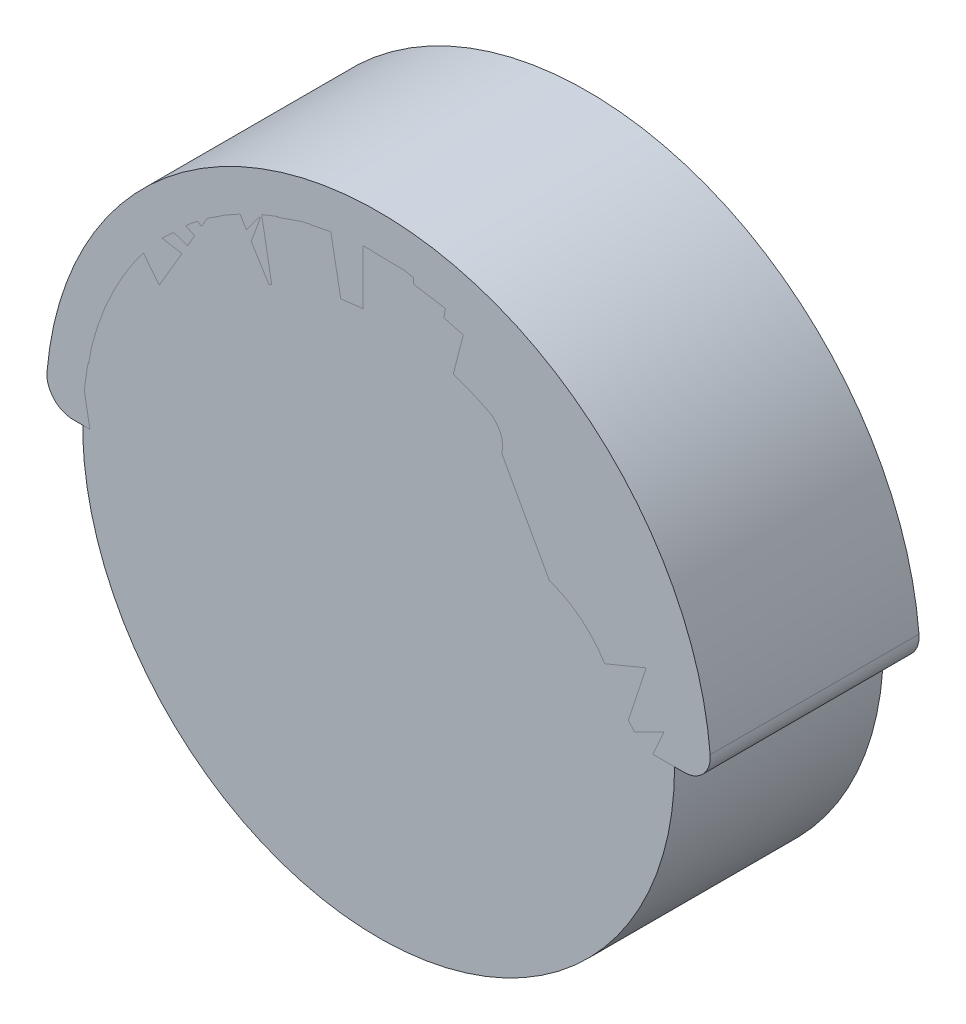
ISO-10303-21;
HEADER;
FILE_DESCRIPTION(('STEP AP214'),'2;1');
FILE_NAME('part.step','',(''),(''),'','','');
FILE_SCHEMA(('AUTOMOTIVE_DESIGN { 1 0 10303 214 1 1 1 1 }'));
ENDSEC;
DATA;
#1=APPLICATION_CONTEXT('core data for automotive mechanical design processes');
#2=APPLICATION_PROTOCOL_DEFINITION('international standard','automotive_design',2000,#1);
#3=PRODUCT_CONTEXT('',#1,'mechanical');
#4=PRODUCT('Part','Part','',(#3));
#5=PRODUCT_RELATED_PRODUCT_CATEGORY('part','',(#4));
#6=PRODUCT_DEFINITION_FORMATION('','',#4);
#7=PRODUCT_DEFINITION_CONTEXT('part definition',#1,'design');
#8=PRODUCT_DEFINITION('design','',#6,#7);
#9=PRODUCT_DEFINITION_SHAPE('','',#8);
#10=(LENGTH_UNIT() NAMED_UNIT(*) SI_UNIT(.MILLI.,.METRE.));
#11=(NAMED_UNIT(*) PLANE_ANGLE_UNIT() SI_UNIT($,.RADIAN.));
#12=(NAMED_UNIT(*) SI_UNIT($,.STERADIAN.) SOLID_ANGLE_UNIT());
#13=UNCERTAINTY_MEASURE_WITH_UNIT(LENGTH_MEASURE(1.E-05),#10,'distance_accuracy_value','');
#14=(GEOMETRIC_REPRESENTATION_CONTEXT(3) GLOBAL_UNCERTAINTY_ASSIGNED_CONTEXT((#13)) GLOBAL_UNIT_ASSIGNED_CONTEXT((#10,
#11,#12)) REPRESENTATION_CONTEXT('',''));
#15=CARTESIAN_POINT('',(0.,0.,0.));
#16=DIRECTION('',(0.,0.,1.));
#17=DIRECTION('',(1.,0.,0.));
#18=AXIS2_PLACEMENT_3D('',#15,#16,#17);
#19=CARTESIAN_POINT('',(0.,0.,-32.0745975710979));
#20=DIRECTION('',(0.,0.,1.));
#21=DIRECTION('',(1.,0.,0.));
#22=AXIS2_PLACEMENT_3D('',#19,#20,#21);
#23=CYLINDRICAL_SURFACE('',#22,11.3400827231764);
#24=CARTESIAN_POINT('',(0.,0.,0.));
#25=DIRECTION('',(0.,0.,1.));
#26=DIRECTION('',(1.,0.,0.));
#27=AXIS2_PLACEMENT_3D('',#24,#25,#26);
#28=CIRCLE('',#27,11.3400827231764);
#29=CARTESIAN_POINT('',(11.3400827231764,0.,0.));
#30=VERTEX_POINT('',#29);
#31=EDGE_CURVE('P0_E10',#30,#30,#28,.F.);
#32=ORIENTED_EDGE('',*,*,#31,.F.);
#33=EDGE_LOOP('',(#32));
#34=FACE_BOUND('',#33,.T.);
#35=CARTESIAN_POINT('',(0.,0.,8.));
#36=DIRECTION('',(0.,0.,1.));
#37=DIRECTION('',(1.,0.,0.));
#38=AXIS2_PLACEMENT_3D('',#35,#36,#37);
#39=CIRCLE('',#38,11.3400827231764);
#40=CARTESIAN_POINT('',(11.3400827231764,0.,8.));
#41=VERTEX_POINT('',#40);
#42=EDGE_CURVE('P0_E45',#41,#41,#39,.T.);
#43=ORIENTED_EDGE('',*,*,#42,.F.);
#44=EDGE_LOOP('',(#43));
#45=FACE_BOUND('',#44,.T.);
#46=ADVANCED_FACE('P0_F39',(#34,#45),#23,.T.);
#47=CARTESIAN_POINT('',(0.,0.,8.));
#48=DIRECTION('',(0.,0.,1.));
#49=DIRECTION('',(1.,0.,0.));
#50=AXIS2_PLACEMENT_3D('',#47,#48,#49);
#51=PLANE('',#50);
#52=ORIENTED_EDGE('',*,*,#42,.T.);
#53=EDGE_LOOP('',(#52));
#54=FACE_BOUND('',#53,.T.);
#55=ADVANCED_FACE('P0_F51',(#54),#51,.T.);
#56=CARTESIAN_POINT('',(0.,0.,0.));
#57=DIRECTION('',(0.,0.,1.));
#58=DIRECTION('',(1.,0.,0.));
#59=AXIS2_PLACEMENT_3D('',#56,#57,#58);
#60=PLANE('',#59);
#61=ORIENTED_EDGE('',*,*,#31,.T.);
#62=EDGE_LOOP('',(#61));
#63=FACE_BOUND('',#62,.T.);
#64=ADVANCED_FACE('P0_F58',(#63),#60,.F.);
#65=CLOSED_SHELL('',(#46,#55,#64));
#66=MANIFOLD_SOLID_BREP('P0_B2',#65);
#67=CARTESIAN_POINT('',(11.7073694739681,1.,8.));
#68=DIRECTION('',(0.,0.,1.));
#69=DIRECTION('',(1.,0.,0.));
#70=AXIS2_PLACEMENT_3D('',#67,#68,#69);
#71=CYLINDRICAL_SURFACE('',#70,1.);
#72=CARTESIAN_POINT('',(11.7073694739681,1.,8.));
#73=DIRECTION('',(0.,0.,-1.));
#74=DIRECTION('',(0.,-1.,0.));
#75=AXIS2_PLACEMENT_3D('',#72,#73,#74);
#76=CIRCLE('',#75,1.);
#77=CARTESIAN_POINT('',(12.703741344093,1.08510638297872,8.));
#78=VERTEX_POINT('',#77);
#79=CARTESIAN_POINT('',(11.7073694739681,0.,8.));
#80=VERTEX_POINT('',#79);
#81=EDGE_CURVE('P1_E11',#78,#80,#76,.T.);
#82=ORIENTED_EDGE('',*,*,#81,.T.);
#83=DIRECTION('',(0.,0.,-1.));
#84=VECTOR('',#83,1.);
#85=CARTESIAN_POINT('',(11.7073694739681,0.,8.));
#86=LINE('',#85,#84);
#87=CARTESIAN_POINT('',(11.7073694739681,0.,0.));
#88=VERTEX_POINT('',#87);
#89=EDGE_CURVE('P1_E27',#80,#88,#86,.T.);
#90=ORIENTED_EDGE('',*,*,#89,.T.);
#91=CARTESIAN_POINT('',(11.7073694739681,1.,0.));
#92=DIRECTION('',(0.,0.,1.));
#93=DIRECTION('',(1.,0.,0.));
#94=AXIS2_PLACEMENT_3D('',#91,#92,#93);
#95=CIRCLE('',#94,1.);
#96=CARTESIAN_POINT('',(12.703741344093,1.08510638297872,0.));
#97=VERTEX_POINT('',#96);
#98=EDGE_CURVE('P1_E325',#88,#97,#95,.T.);
#99=ORIENTED_EDGE('',*,*,#98,.T.);
#100=DIRECTION('',(0.,0.,1.));
#101=VECTOR('',#100,1.);
#102=CARTESIAN_POINT('',(12.703741344093,1.08510638297872,8.));
#103=LINE('',#102,#101);
#104=EDGE_CURVE('P1_E326',#97,#78,#103,.T.);
#105=ORIENTED_EDGE('',*,*,#104,.T.);
#106=EDGE_LOOP('',(#82,#90,#99,#105));
#107=FACE_BOUND('',#106,.T.);
#108=ADVANCED_FACE('P1_F17',(#107),#71,.T.);
#109=CARTESIAN_POINT('',(0.,0.,8.));
#110=DIRECTION('',(0.,0.,-1.));
#111=DIRECTION('',(0.,-1.,0.));
#112=AXIS2_PLACEMENT_3D('',#109,#110,#111);
#113=CYLINDRICAL_SURFACE('',#112,12.75);
#114=ORIENTED_EDGE('',*,*,#104,.F.);
#115=CARTESIAN_POINT('',(0.,0.,0.));
#116=DIRECTION('',(0.,0.,-1.));
#117=DIRECTION('',(0.,-1.,0.));
#118=AXIS2_PLACEMENT_3D('',#115,#116,#117);
#119=CIRCLE('',#118,12.75);
#120=CARTESIAN_POINT('',(-12.703741344093,1.08510638297872,0.));
#121=VERTEX_POINT('',#120);
#122=EDGE_CURVE('P1_E208',#121,#97,#119,.T.);
#123=ORIENTED_EDGE('',*,*,#122,.F.);
#124=DIRECTION('',(0.,0.,-1.));
#125=VECTOR('',#124,1.);
#126=CARTESIAN_POINT('',(-12.703741344093,1.08510638297872,8.));
#127=LINE('',#126,#125);
#128=CARTESIAN_POINT('',(-12.703741344093,1.08510638297872,8.));
#129=VERTEX_POINT('',#128);
#130=EDGE_CURVE('P1_E243',#129,#121,#127,.T.);
#131=ORIENTED_EDGE('',*,*,#130,.F.);
#132=CARTESIAN_POINT('',(0.,0.,8.));
#133=DIRECTION('',(0.,0.,1.));
#134=DIRECTION('',(0.,-1.,0.));
#135=AXIS2_PLACEMENT_3D('',#132,#133,#134);
#136=CIRCLE('',#135,12.75);
#137=EDGE_CURVE('P1_E304',#78,#129,#136,.T.);
#138=ORIENTED_EDGE('',*,*,#137,.F.);
#139=EDGE_LOOP('',(#114,#123,#131,#138));
#140=FACE_BOUND('',#139,.T.);
#141=ADVANCED_FACE('P1_F338',(#140),#113,.T.);
#142=CARTESIAN_POINT('',(0.,0.,0.));
#143=DIRECTION('',(0.,0.,1.));
#144=DIRECTION('',(1.,0.,0.));
#145=AXIS2_PLACEMENT_3D('',#142,#143,#144);
#146=PLANE('',#145);
#147=ORIENTED_EDGE('',*,*,#98,.F.);
#148=DIRECTION('',(-1.,0.,0.));
#149=VECTOR('',#148,1.);
#150=CARTESIAN_POINT('',(9.25,0.,0.));
#151=LINE('',#150,#149);
#152=CARTESIAN_POINT('',(10.1489794855664,0.,0.));
#153=VERTEX_POINT('',#152);
#154=EDGE_CURVE('P1_E183',#88,#153,#151,.T.);
#155=ORIENTED_EDGE('',*,*,#154,.T.);
#156=CARTESIAN_POINT('',(10.1489794855664,1.,0.));
#157=DIRECTION('',(0.,0.,1.));
#158=DIRECTION('',(1.,0.,0.));
#159=AXIS2_PLACEMENT_3D('',#156,#157,#158);
#160=CIRCLE('',#159,1.);
#161=CARTESIAN_POINT('',(9.16918358845309,0.800000000000001,0.));
#162=VERTEX_POINT('',#161);
#163=EDGE_CURVE('P1_E174',#162,#153,#160,.T.);
#164=ORIENTED_EDGE('',*,*,#163,.F.);
#165=CARTESIAN_POINT('',(5.25,0.,0.));
#166=DIRECTION('',(0.,0.,1.));
#167=DIRECTION('',(1.,0.,0.));
#168=AXIS2_PLACEMENT_3D('',#165,#166,#167);
#169=CIRCLE('',#168,4.);
#170=CARTESIAN_POINT('',(2.63888888888889,3.03019780962103,0.));
#171=VERTEX_POINT('',#170);
#172=EDGE_CURVE('P1_E185',#162,#171,#169,.T.);
#173=ORIENTED_EDGE('',*,*,#172,.T.);
#174=CARTESIAN_POINT('',(3.29166666666667,2.27264835721577,0.));
#175=DIRECTION('',(0.,0.,-1.));
#176=DIRECTION('',(0.,-1.,0.));
#177=AXIS2_PLACEMENT_3D('',#174,#175,#176);
#178=CIRCLE('',#177,1.);
#179=CARTESIAN_POINT('',(2.46875,1.70448626791183,0.));
#180=VERTEX_POINT('',#179);
#181=EDGE_CURVE('P1_E189',#180,#171,#178,.T.);
#182=ORIENTED_EDGE('',*,*,#181,.F.);
#183=CARTESIAN_POINT('',(0.,0.,0.));
#184=DIRECTION('',(0.,0.,-1.));
#185=DIRECTION('',(0.,-1.,0.));
#186=AXIS2_PLACEMENT_3D('',#183,#184,#185);
#187=CIRCLE('',#186,3.);
#188=CARTESIAN_POINT('',(-2.46875,1.70448626791183,0.));
#189=VERTEX_POINT('',#188);
#190=EDGE_CURVE('P1_E188',#180,#189,#187,.T.);
#191=ORIENTED_EDGE('',*,*,#190,.T.);
#192=CARTESIAN_POINT('',(-3.29166666666667,2.27264835721577,0.));
#193=DIRECTION('',(0.,0.,-1.));
#194=DIRECTION('',(0.,-1.,0.));
#195=AXIS2_PLACEMENT_3D('',#192,#193,#194);
#196=CIRCLE('',#195,1.);
#197=CARTESIAN_POINT('',(-2.63888888888889,3.03019780962103,0.));
#198=VERTEX_POINT('',#197);
#199=EDGE_CURVE('P1_E196',#198,#189,#196,.T.);
#200=ORIENTED_EDGE('',*,*,#199,.F.);
#201=CARTESIAN_POINT('',(-5.25,0.,0.));
#202=DIRECTION('',(0.,0.,1.));
#203=DIRECTION('',(1.,0.,0.));
#204=AXIS2_PLACEMENT_3D('',#201,#202,#203);
#205=CIRCLE('',#204,4.);
#206=CARTESIAN_POINT('',(-9.16918358845309,0.8,0.));
#207=VERTEX_POINT('',#206);
#208=EDGE_CURVE('P1_E195',#198,#207,#205,.T.);
#209=ORIENTED_EDGE('',*,*,#208,.T.);
#210=CARTESIAN_POINT('',(-10.1489794855664,1.,0.));
#211=DIRECTION('',(0.,0.,1.));
#212=DIRECTION('',(1.,0.,0.));
#213=AXIS2_PLACEMENT_3D('',#210,#211,#212);
#214=CIRCLE('',#213,1.);
#215=CARTESIAN_POINT('',(-10.1489794855664,0.,0.));
#216=VERTEX_POINT('',#215);
#217=EDGE_CURVE('P1_E202',#216,#207,#214,.T.);
#218=ORIENTED_EDGE('',*,*,#217,.F.);
#219=DIRECTION('',(-1.,0.,0.));
#220=VECTOR('',#219,1.);
#221=CARTESIAN_POINT('',(-11.75,0.,0.));
#222=LINE('',#221,#220);
#223=CARTESIAN_POINT('',(-11.7073694739681,0.,0.));
#224=VERTEX_POINT('',#223);
#225=EDGE_CURVE('P1_E201',#216,#224,#222,.T.);
#226=ORIENTED_EDGE('',*,*,#225,.T.);
#227=CARTESIAN_POINT('',(-11.7073694739681,0.999999999999999,0.));
#228=DIRECTION('',(0.,0.,1.));
#229=DIRECTION('',(1.,0.,0.));
#230=AXIS2_PLACEMENT_3D('',#227,#228,#229);
#231=CIRCLE('',#230,1.);
#232=EDGE_CURVE('P1_E209',#121,#224,#231,.T.);
#233=ORIENTED_EDGE('',*,*,#232,.F.);
#234=ORIENTED_EDGE('',*,*,#122,.T.);
#235=EDGE_LOOP('',(#147,#155,#164,#173,#182,#191,#200,#209,#218,#226,#233,#234));
#236=FACE_BOUND('',#235,.T.);
#237=CARTESIAN_POINT('',(5.25,0.,0.));
#238=DIRECTION('',(0.,0.,-1.));
#239=DIRECTION('',(0.,-1.,0.));
#240=AXIS2_PLACEMENT_3D('',#237,#238,#239);
#241=CIRCLE('',#240,6.5);
#242=CARTESIAN_POINT('',(0.700000000000001,4.64192847855285,0.));
#243=VERTEX_POINT('',#242);
#244=CARTESIAN_POINT('',(3.95,6.36867333123626,0.));
#245=VERTEX_POINT('',#244);
#246=EDGE_CURVE('P1_E213',#243,#245,#241,.T.);
#247=ORIENTED_EDGE('',*,*,#246,.T.);
#248=CARTESIAN_POINT('',(3.75,7.34846922834953,0.));
#249=DIRECTION('',(0.,0.,-1.));
#250=DIRECTION('',(0.,-1.,0.));
#251=AXIS2_PLACEMENT_3D('',#248,#249,#250);
#252=CIRCLE('',#251,1.);
#253=CARTESIAN_POINT('',(4.20454545454546,8.23919277117978,0.));
#254=VERTEX_POINT('',#253);
#255=EDGE_CURVE('P1_E217',#254,#245,#252,.T.);
#256=ORIENTED_EDGE('',*,*,#255,.F.);
#257=CARTESIAN_POINT('',(0.,0.,0.));
#258=DIRECTION('',(0.,0.,1.));
#259=DIRECTION('',(1.,0.,0.));
#260=AXIS2_PLACEMENT_3D('',#257,#258,#259);
#261=CIRCLE('',#260,9.25);
#262=CARTESIAN_POINT('',(-4.20454545454546,8.23919277117978,0.));
#263=VERTEX_POINT('',#262);
#264=EDGE_CURVE('P1_E216',#254,#263,#261,.T.);
#265=ORIENTED_EDGE('',*,*,#264,.T.);
#266=CARTESIAN_POINT('',(-3.75,7.34846922834953,0.));
#267=DIRECTION('',(0.,0.,-1.));
#268=DIRECTION('',(0.,-1.,0.));
#269=AXIS2_PLACEMENT_3D('',#266,#267,#268);
#270=CIRCLE('',#269,1.);
#271=CARTESIAN_POINT('',(-3.95,6.36867333123626,0.));
#272=VERTEX_POINT('',#271);
#273=EDGE_CURVE('P1_E224',#272,#263,#270,.T.);
#274=ORIENTED_EDGE('',*,*,#273,.F.);
#275=CARTESIAN_POINT('',(-5.25,0.,0.));
#276=DIRECTION('',(0.,0.,-1.));
#277=DIRECTION('',(0.,-1.,0.));
#278=AXIS2_PLACEMENT_3D('',#275,#276,#277);
#279=CIRCLE('',#278,6.5);
#280=CARTESIAN_POINT('',(-0.7,4.64192847855285,0.));
#281=VERTEX_POINT('',#280);
#282=EDGE_CURVE('P1_E223',#272,#281,#279,.T.);
#283=ORIENTED_EDGE('',*,*,#282,.T.);
#284=CARTESIAN_POINT('',(0.,5.35607132140714,0.));
#285=DIRECTION('',(0.,0.,-1.));
#286=DIRECTION('',(0.,-1.,0.));
#287=AXIS2_PLACEMENT_3D('',#284,#285,#286);
#288=CIRCLE('',#287,1.);
#289=EDGE_CURVE('P1_E231',#243,#281,#288,.T.);
#290=ORIENTED_EDGE('',*,*,#289,.F.);
#291=EDGE_LOOP('',(#247,#256,#265,#274,#283,#290));
#292=FACE_BOUND('',#291,.T.);
#293=CARTESIAN_POINT('',(0.,0.,0.));
#294=DIRECTION('',(0.,0.,1.));
#295=DIRECTION('',(1.,0.,0.));
#296=AXIS2_PLACEMENT_3D('',#293,#294,#295);
#297=CIRCLE('',#296,1.575);
#298=CARTESIAN_POINT('',(1.12722003175955,-1.1,0.));
#299=VERTEX_POINT('',#298);
#300=CARTESIAN_POINT('',(-1.12722003175955,-1.1,0.));
#301=VERTEX_POINT('',#300);
#302=EDGE_CURVE('P1_E230',#299,#301,#297,.T.);
#303=ORIENTED_EDGE('',*,*,#302,.T.);
#304=DIRECTION('',(1.,0.,0.));
#305=VECTOR('',#304,1.);
#306=CARTESIAN_POINT('',(1.12722003175955,-1.1,0.));
#307=LINE('',#306,#305);
#308=EDGE_CURVE('P1_E211',#301,#299,#307,.T.);
#309=ORIENTED_EDGE('',*,*,#308,.T.);
#310=EDGE_LOOP('',(#303,#309));
#311=FACE_BOUND('',#310,.T.);
#312=ADVANCED_FACE('P1_F321',(#236,#292,#311),#146,.F.);
#313=CARTESIAN_POINT('',(-11.7073694739681,0.999999999999999,8.));
#314=DIRECTION('',(0.,0.,-1.));
#315=DIRECTION('',(0.,-1.,0.));
#316=AXIS2_PLACEMENT_3D('',#313,#314,#315);
#317=CYLINDRICAL_SURFACE('',#316,1.);
#318=ORIENTED_EDGE('',*,*,#232,.T.);
#319=DIRECTION('',(0.,0.,1.));
#320=VECTOR('',#319,1.);
#321=CARTESIAN_POINT('',(-11.7073694739681,0.,8.));
#322=LINE('',#321,#320);
#323=CARTESIAN_POINT('',(-11.7073694739681,0.,8.));
#324=VERTEX_POINT('',#323);
#325=EDGE_CURVE('P1_E212',#224,#324,#322,.T.);
#326=ORIENTED_EDGE('',*,*,#325,.T.);
#327=CARTESIAN_POINT('',(-11.7073694739681,0.999999999999999,8.));
#328=DIRECTION('',(0.,0.,-1.));
#329=DIRECTION('',(0.,-1.,0.));
#330=AXIS2_PLACEMENT_3D('',#327,#328,#329);
#331=CIRCLE('',#330,1.);
#332=EDGE_CURVE('P1_E240',#324,#129,#331,.T.);
#333=ORIENTED_EDGE('',*,*,#332,.T.);
#334=ORIENTED_EDGE('',*,*,#130,.T.);
#335=EDGE_LOOP('',(#318,#326,#333,#334));
#336=FACE_BOUND('',#335,.T.);
#337=ADVANCED_FACE('P1_F341',(#336),#317,.T.);
#338=CARTESIAN_POINT('',(-1.12722003175955,-1.1,8.));
#339=DIRECTION('',(0.,1.,0.));
#340=DIRECTION('',(0.,0.,1.));
#341=AXIS2_PLACEMENT_3D('',#338,#339,#340);
#342=PLANE('',#341);
#343=DIRECTION('',(-1.,0.,0.));
#344=VECTOR('',#343,1.);
#345=CARTESIAN_POINT('',(1.12722003175955,-1.1,8.));
#346=LINE('',#345,#344);
#347=CARTESIAN_POINT('',(1.12722003175955,-1.1,8.));
#348=VERTEX_POINT('',#347);
#349=CARTESIAN_POINT('',(-1.12722003175955,-1.1,8.));
#350=VERTEX_POINT('',#349);
#351=EDGE_CURVE('P1_E244',#348,#350,#346,.T.);
#352=ORIENTED_EDGE('',*,*,#351,.F.);
#353=DIRECTION('',(0.,0.,1.));
#354=VECTOR('',#353,1.);
#355=CARTESIAN_POINT('',(1.12722003175955,-1.1,0.));
#356=LINE('',#355,#354);
#357=EDGE_CURVE('P1_E247',#299,#348,#356,.T.);
#358=ORIENTED_EDGE('',*,*,#357,.F.);
#359=ORIENTED_EDGE('',*,*,#308,.F.);
#360=DIRECTION('',(0.,0.,-1.));
#361=VECTOR('',#360,1.);
#362=CARTESIAN_POINT('',(-1.12722003175955,-1.1,0.));
#363=LINE('',#362,#361);
#364=EDGE_CURVE('P1_E250',#350,#301,#363,.T.);
#365=ORIENTED_EDGE('',*,*,#364,.F.);
#366=EDGE_LOOP('',(#352,#358,#359,#365));
#367=FACE_BOUND('',#366,.T.);
#368=ADVANCED_FACE('P1_F382',(#367),#342,.T.);
#369=CARTESIAN_POINT('',(0.,0.,0.));
#370=DIRECTION('',(0.,0.,1.));
#371=DIRECTION('',(1.,0.,0.));
#372=AXIS2_PLACEMENT_3D('',#369,#370,#371);
#373=CYLINDRICAL_SURFACE('',#372,1.575);
#374=ORIENTED_EDGE('',*,*,#357,.T.);
#375=CARTESIAN_POINT('',(0.,0.,8.));
#376=DIRECTION('',(0.,0.,-1.));
#377=DIRECTION('',(0.,-1.,0.));
#378=AXIS2_PLACEMENT_3D('',#375,#376,#377);
#379=CIRCLE('',#378,1.575);
#380=EDGE_CURVE('P1_E172',#350,#348,#379,.T.);
#381=ORIENTED_EDGE('',*,*,#380,.F.);
#382=ORIENTED_EDGE('',*,*,#364,.T.);
#383=ORIENTED_EDGE('',*,*,#302,.F.);
#384=EDGE_LOOP('',(#374,#381,#382,#383));
#385=FACE_BOUND('',#384,.T.);
#386=ADVANCED_FACE('P1_F379',(#385),#373,.F.);
#387=CARTESIAN_POINT('',(3.75,7.34846922834953,8.));
#388=DIRECTION('',(0.,0.,-1.));
#389=DIRECTION('',(0.,-1.,0.));
#390=AXIS2_PLACEMENT_3D('',#387,#388,#389);
#391=CYLINDRICAL_SURFACE('',#390,1.);
#392=CARTESIAN_POINT('',(3.75,7.34846922834953,8.));
#393=DIRECTION('',(0.,0.,1.));
#394=DIRECTION('',(1.,0.,0.));
#395=AXIS2_PLACEMENT_3D('',#392,#393,#394);
#396=CIRCLE('',#395,1.);
#397=CARTESIAN_POINT('',(3.95,6.36867333123626,8.));
#398=VERTEX_POINT('',#397);
#399=CARTESIAN_POINT('',(4.20454545454546,8.23919277117978,8.));
#400=VERTEX_POINT('',#399);
#401=EDGE_CURVE('P1_E253',#398,#400,#396,.T.);
#402=ORIENTED_EDGE('',*,*,#401,.T.);
#403=DIRECTION('',(0.,0.,-1.));
#404=VECTOR('',#403,1.);
#405=CARTESIAN_POINT('',(4.20454545454546,8.23919277117978,8.));
#406=LINE('',#405,#404);
#407=EDGE_CURVE('P1_E219',#400,#254,#406,.T.);
#408=ORIENTED_EDGE('',*,*,#407,.T.);
#409=ORIENTED_EDGE('',*,*,#255,.T.);
#410=DIRECTION('',(0.,0.,1.));
#411=VECTOR('',#410,1.);
#412=CARTESIAN_POINT('',(3.95,6.36867333123626,8.));
#413=LINE('',#412,#411);
#414=EDGE_CURVE('P1_E220',#245,#398,#413,.T.);
#415=ORIENTED_EDGE('',*,*,#414,.T.);
#416=EDGE_LOOP('',(#402,#408,#409,#415));
#417=FACE_BOUND('',#416,.T.);
#418=ADVANCED_FACE('P1_F381',(#417),#391,.F.);
#419=CARTESIAN_POINT('',(0.,0.,8.));
#420=DIRECTION('',(0.,0.,-1.));
#421=DIRECTION('',(0.,-1.,0.));
#422=AXIS2_PLACEMENT_3D('',#419,#420,#421);
#423=CYLINDRICAL_SURFACE('',#422,9.25);
#424=ORIENTED_EDGE('',*,*,#407,.F.);
#425=CARTESIAN_POINT('',(0.,0.,8.));
#426=DIRECTION('',(0.,0.,-1.));
#427=DIRECTION('',(0.,-1.,0.));
#428=AXIS2_PLACEMENT_3D('',#425,#426,#427);
#429=CIRCLE('',#428,9.25);
#430=CARTESIAN_POINT('',(-4.20454545454546,8.23919277117978,8.));
#431=VERTEX_POINT('',#430);
#432=EDGE_CURVE('P1_E176',#431,#400,#429,.T.);
#433=ORIENTED_EDGE('',*,*,#432,.F.);
#434=DIRECTION('',(0.,0.,1.));
#435=VECTOR('',#434,1.);
#436=CARTESIAN_POINT('',(-4.20454545454546,8.23919277117978,8.));
#437=LINE('',#436,#435);
#438=EDGE_CURVE('P1_E227',#263,#431,#437,.T.);
#439=ORIENTED_EDGE('',*,*,#438,.F.);
#440=ORIENTED_EDGE('',*,*,#264,.F.);
#441=EDGE_LOOP('',(#424,#433,#439,#440));
#442=FACE_BOUND('',#441,.T.);
#443=ADVANCED_FACE('P1_F385',(#442),#423,.F.);
#444=CARTESIAN_POINT('',(-3.75,7.34846922834953,8.));
#445=DIRECTION('',(0.,0.,-1.));
#446=DIRECTION('',(0.,-1.,0.));
#447=AXIS2_PLACEMENT_3D('',#444,#445,#446);
#448=CYLINDRICAL_SURFACE('',#447,1.);
#449=CARTESIAN_POINT('',(-3.75,7.34846922834953,8.));
#450=DIRECTION('',(0.,0.,1.));
#451=DIRECTION('',(1.,0.,0.));
#452=AXIS2_PLACEMENT_3D('',#449,#450,#451);
#453=CIRCLE('',#452,1.);
#454=CARTESIAN_POINT('',(-3.95,6.36867333123626,8.));
#455=VERTEX_POINT('',#454);
#456=EDGE_CURVE('P1_E260',#431,#455,#453,.T.);
#457=ORIENTED_EDGE('',*,*,#456,.T.);
#458=DIRECTION('',(0.,0.,-1.));
#459=VECTOR('',#458,1.);
#460=CARTESIAN_POINT('',(-3.95,6.36867333123626,8.));
#461=LINE('',#460,#459);
#462=EDGE_CURVE('P1_E226',#455,#272,#461,.T.);
#463=ORIENTED_EDGE('',*,*,#462,.T.);
#464=ORIENTED_EDGE('',*,*,#273,.T.);
#465=ORIENTED_EDGE('',*,*,#438,.T.);
#466=EDGE_LOOP('',(#457,#463,#464,#465));
#467=FACE_BOUND('',#466,.T.);
#468=ADVANCED_FACE('P1_F377',(#467),#448,.F.);
#469=CARTESIAN_POINT('',(-5.25,0.,8.));
#470=DIRECTION('',(0.,0.,-1.));
#471=DIRECTION('',(0.,-1.,0.));
#472=AXIS2_PLACEMENT_3D('',#469,#470,#471);
#473=CYLINDRICAL_SURFACE('',#472,6.5);
#474=ORIENTED_EDGE('',*,*,#462,.F.);
#475=CARTESIAN_POINT('',(-5.25,0.,8.));
#476=DIRECTION('',(0.,0.,1.));
#477=DIRECTION('',(1.,0.,0.));
#478=AXIS2_PLACEMENT_3D('',#475,#476,#477);
#479=CIRCLE('',#478,6.5);
#480=CARTESIAN_POINT('',(-0.7,4.64192847855285,8.));
#481=VERTEX_POINT('',#480);
#482=EDGE_CURVE('P1_E179',#481,#455,#479,.T.);
#483=ORIENTED_EDGE('',*,*,#482,.F.);
#484=DIRECTION('',(0.,0.,1.));
#485=VECTOR('',#484,1.);
#486=CARTESIAN_POINT('',(-0.7,4.64192847855285,8.));
#487=LINE('',#486,#485);
#488=EDGE_CURVE('P1_E234',#281,#481,#487,.T.);
#489=ORIENTED_EDGE('',*,*,#488,.F.);
#490=ORIENTED_EDGE('',*,*,#282,.F.);
#491=EDGE_LOOP('',(#474,#483,#489,#490));
#492=FACE_BOUND('',#491,.T.);
#493=ADVANCED_FACE('P1_F374',(#492),#473,.T.);
#494=CARTESIAN_POINT('',(0.,5.35607132140714,8.));
#495=DIRECTION('',(0.,0.,-1.));
#496=DIRECTION('',(0.,-1.,0.));
#497=AXIS2_PLACEMENT_3D('',#494,#495,#496);
#498=CYLINDRICAL_SURFACE('',#497,1.);
#499=CARTESIAN_POINT('',(0.,5.35607132140714,8.));
#500=DIRECTION('',(0.,0.,1.));
#501=DIRECTION('',(1.,0.,0.));
#502=AXIS2_PLACEMENT_3D('',#499,#500,#501);
#503=CIRCLE('',#502,1.);
#504=CARTESIAN_POINT('',(0.700000000000001,4.64192847855285,8.));
#505=VERTEX_POINT('',#504);
#506=EDGE_CURVE('P1_E264',#481,#505,#503,.T.);
#507=ORIENTED_EDGE('',*,*,#506,.T.);
#508=DIRECTION('',(0.,0.,-1.));
#509=VECTOR('',#508,1.);
#510=CARTESIAN_POINT('',(0.7,4.64192847855285,8.));
#511=LINE('',#510,#509);
#512=EDGE_CURVE('P1_E233',#505,#243,#511,.T.);
#513=ORIENTED_EDGE('',*,*,#512,.T.);
#514=ORIENTED_EDGE('',*,*,#289,.T.);
#515=ORIENTED_EDGE('',*,*,#488,.T.);
#516=EDGE_LOOP('',(#507,#513,#514,#515));
#517=FACE_BOUND('',#516,.T.);
#518=ADVANCED_FACE('P1_F19',(#517),#498,.F.);
#519=CARTESIAN_POINT('',(5.25,0.,8.));
#520=DIRECTION('',(0.,0.,-1.));
#521=DIRECTION('',(0.,-1.,0.));
#522=AXIS2_PLACEMENT_3D('',#519,#520,#521);
#523=CYLINDRICAL_SURFACE('',#522,6.5);
#524=ORIENTED_EDGE('',*,*,#414,.F.);
#525=ORIENTED_EDGE('',*,*,#246,.F.);
#526=ORIENTED_EDGE('',*,*,#512,.F.);
#527=CARTESIAN_POINT('',(5.25,0.,8.));
#528=DIRECTION('',(0.,0.,1.));
#529=DIRECTION('',(1.,0.,0.));
#530=AXIS2_PLACEMENT_3D('',#527,#528,#529);
#531=CIRCLE('',#530,6.5);
#532=EDGE_CURVE('P1_E246',#398,#505,#531,.T.);
#533=ORIENTED_EDGE('',*,*,#532,.F.);
#534=EDGE_LOOP('',(#524,#525,#526,#533));
#535=FACE_BOUND('',#534,.T.);
#536=ADVANCED_FACE('P1_F354',(#535),#523,.T.);
#537=CARTESIAN_POINT('',(-3.29166666666667,2.27264835721577,0.));
#538=DIRECTION('',(0.,0.,-1.));
#539=DIRECTION('',(0.,-1.,0.));
#540=AXIS2_PLACEMENT_3D('',#537,#538,#539);
#541=CYLINDRICAL_SURFACE('',#540,1.);
#542=CARTESIAN_POINT('',(-3.29166666666667,2.27264835721577,8.));
#543=DIRECTION('',(0.,0.,1.));
#544=DIRECTION('',(1.,0.,0.));
#545=AXIS2_PLACEMENT_3D('',#542,#543,#544);
#546=CIRCLE('',#545,1.);
#547=CARTESIAN_POINT('',(-2.46875,1.70448626791183,8.));
#548=VERTEX_POINT('',#547);
#549=CARTESIAN_POINT('',(-2.63888888888889,3.03019780962103,8.));
#550=VERTEX_POINT('',#549);
#551=EDGE_CURVE('P1_E273',#548,#550,#546,.T.);
#552=ORIENTED_EDGE('',*,*,#551,.T.);
#553=DIRECTION('',(0.,0.,-1.));
#554=VECTOR('',#553,1.);
#555=CARTESIAN_POINT('',(-2.63888888888889,3.03019780962103,0.));
#556=LINE('',#555,#554);
#557=EDGE_CURVE('P1_E198',#550,#198,#556,.T.);
#558=ORIENTED_EDGE('',*,*,#557,.T.);
#559=ORIENTED_EDGE('',*,*,#199,.T.);
#560=DIRECTION('',(0.,0.,1.));
#561=VECTOR('',#560,1.);
#562=CARTESIAN_POINT('',(-2.46875,1.70448626791183,0.));
#563=LINE('',#562,#561);
#564=EDGE_CURVE('P1_E191',#189,#548,#563,.T.);
#565=ORIENTED_EDGE('',*,*,#564,.T.);
#566=EDGE_LOOP('',(#552,#558,#559,#565));
#567=FACE_BOUND('',#566,.T.);
#568=ADVANCED_FACE('P1_F352',(#567),#541,.F.);
#569=CARTESIAN_POINT('',(-5.25,0.,8.));
#570=DIRECTION('',(0.,0.,-1.));
#571=DIRECTION('',(0.,-1.,0.));
#572=AXIS2_PLACEMENT_3D('',#569,#570,#571);
#573=CYLINDRICAL_SURFACE('',#572,4.);
#574=ORIENTED_EDGE('',*,*,#557,.F.);
#575=CARTESIAN_POINT('',(-5.25,0.,8.));
#576=DIRECTION('',(0.,0.,-1.));
#577=DIRECTION('',(0.,-1.,0.));
#578=AXIS2_PLACEMENT_3D('',#575,#576,#577);
#579=CIRCLE('',#578,4.);
#580=CARTESIAN_POINT('',(-9.16918358845309,0.8,8.));
#581=VERTEX_POINT('',#580);
#582=EDGE_CURVE('P1_E285',#581,#550,#579,.T.);
#583=ORIENTED_EDGE('',*,*,#582,.F.);
#584=DIRECTION('',(0.,0.,1.));
#585=VECTOR('',#584,1.);
#586=CARTESIAN_POINT('',(-9.16918358845309,0.8,8.));
#587=LINE('',#586,#585);
#588=EDGE_CURVE('P1_E205',#207,#581,#587,.T.);
#589=ORIENTED_EDGE('',*,*,#588,.F.);
#590=ORIENTED_EDGE('',*,*,#208,.F.);
#591=EDGE_LOOP('',(#574,#583,#589,#590));
#592=FACE_BOUND('',#591,.T.);
#593=ADVANCED_FACE('P1_F350',(#592),#573,.F.);
#594=CARTESIAN_POINT('',(3.29166666666667,2.27264835721577,0.));
#595=DIRECTION('',(0.,0.,1.));
#596=DIRECTION('',(1.,0.,0.));
#597=AXIS2_PLACEMENT_3D('',#594,#595,#596);
#598=CYLINDRICAL_SURFACE('',#597,1.);
#599=ORIENTED_EDGE('',*,*,#181,.T.);
#600=DIRECTION('',(0.,0.,1.));
#601=VECTOR('',#600,1.);
#602=CARTESIAN_POINT('',(2.63888888888889,3.03019780962103,0.));
#603=LINE('',#602,#601);
#604=CARTESIAN_POINT('',(2.63888888888889,3.03019780962103,8.));
#605=VERTEX_POINT('',#604);
#606=EDGE_CURVE('P1_E192',#171,#605,#603,.T.);
#607=ORIENTED_EDGE('',*,*,#606,.T.);
#608=CARTESIAN_POINT('',(3.29166666666667,2.27264835721577,8.));
#609=DIRECTION('',(0.,0.,1.));
#610=DIRECTION('',(1.,0.,0.));
#611=AXIS2_PLACEMENT_3D('',#608,#609,#610);
#612=CIRCLE('',#611,1.);
#613=CARTESIAN_POINT('',(2.46875,1.70448626791183,8.));
#614=VERTEX_POINT('',#613);
#615=EDGE_CURVE('P1_E295',#605,#614,#612,.T.);
#616=ORIENTED_EDGE('',*,*,#615,.T.);
#617=DIRECTION('',(0.,0.,-1.));
#618=VECTOR('',#617,1.);
#619=CARTESIAN_POINT('',(2.46875,1.70448626791183,0.));
#620=LINE('',#619,#618);
#621=EDGE_CURVE('P1_E204',#614,#180,#620,.T.);
#622=ORIENTED_EDGE('',*,*,#621,.T.);
#623=EDGE_LOOP('',(#599,#607,#616,#622));
#624=FACE_BOUND('',#623,.T.);
#625=ADVANCED_FACE('P1_F315',(#624),#598,.F.);
#626=CARTESIAN_POINT('',(5.25,0.,8.));
#627=DIRECTION('',(0.,0.,-1.));
#628=DIRECTION('',(0.,-1.,0.));
#629=AXIS2_PLACEMENT_3D('',#626,#627,#628);
#630=CYLINDRICAL_SURFACE('',#629,4.);
#631=ORIENTED_EDGE('',*,*,#606,.F.);
#632=ORIENTED_EDGE('',*,*,#172,.F.);
#633=DIRECTION('',(0.,0.,-1.));
#634=VECTOR('',#633,1.);
#635=CARTESIAN_POINT('',(9.16918358845309,0.800000000000001,8.));
#636=LINE('',#635,#634);
#637=CARTESIAN_POINT('',(9.16918358845309,0.800000000000001,8.));
#638=VERTEX_POINT('',#637);
#639=EDGE_CURVE('P1_E168',#638,#162,#636,.T.);
#640=ORIENTED_EDGE('',*,*,#639,.F.);
#641=CARTESIAN_POINT('',(5.25,0.,8.));
#642=DIRECTION('',(0.,0.,-1.));
#643=DIRECTION('',(0.,-1.,0.));
#644=AXIS2_PLACEMENT_3D('',#641,#642,#643);
#645=CIRCLE('',#644,4.);
#646=EDGE_CURVE('P1_E164',#605,#638,#645,.T.);
#647=ORIENTED_EDGE('',*,*,#646,.F.);
#648=EDGE_LOOP('',(#631,#632,#640,#647));
#649=FACE_BOUND('',#648,.T.);
#650=ADVANCED_FACE('P1_F319',(#649),#630,.F.);
#651=CARTESIAN_POINT('',(-10.1489794855664,1.,8.));
#652=DIRECTION('',(0.,0.,-1.));
#653=DIRECTION('',(0.,-1.,0.));
#654=AXIS2_PLACEMENT_3D('',#651,#652,#653);
#655=CYLINDRICAL_SURFACE('',#654,1.);
#656=ORIENTED_EDGE('',*,*,#217,.T.);
#657=ORIENTED_EDGE('',*,*,#588,.T.);
#658=CARTESIAN_POINT('',(-10.1489794855664,1.,8.));
#659=DIRECTION('',(0.,0.,-1.));
#660=DIRECTION('',(0.,-1.,0.));
#661=AXIS2_PLACEMENT_3D('',#658,#659,#660);
#662=CIRCLE('',#661,1.);
#663=CARTESIAN_POINT('',(-10.1489794855664,0.,8.));
#664=VERTEX_POINT('',#663);
#665=EDGE_CURVE('P1_E292',#581,#664,#662,.T.);
#666=ORIENTED_EDGE('',*,*,#665,.T.);
#667=DIRECTION('',(0.,0.,-1.));
#668=VECTOR('',#667,1.);
#669=CARTESIAN_POINT('',(-10.1489794855664,0.,8.));
#670=LINE('',#669,#668);
#671=EDGE_CURVE('P1_E151',#664,#216,#670,.T.);
#672=ORIENTED_EDGE('',*,*,#671,.T.);
#673=EDGE_LOOP('',(#656,#657,#666,#672));
#674=FACE_BOUND('',#673,.T.);
#675=ADVANCED_FACE('P1_F346',(#674),#655,.T.);
#676=CARTESIAN_POINT('',(-9.25,0.,8.));
#677=DIRECTION('',(0.,-1.,0.));
#678=DIRECTION('',(0.,0.,-1.));
#679=AXIS2_PLACEMENT_3D('',#676,#677,#678);
#680=PLANE('',#679);
#681=ORIENTED_EDGE('',*,*,#325,.F.);
#682=ORIENTED_EDGE('',*,*,#225,.F.);
#683=ORIENTED_EDGE('',*,*,#671,.F.);
#684=DIRECTION('',(1.,0.,0.));
#685=VECTOR('',#684,1.);
#686=CARTESIAN_POINT('',(-11.75,0.,8.));
#687=LINE('',#686,#685);
#688=EDGE_CURVE('P1_E288',#324,#664,#687,.T.);
#689=ORIENTED_EDGE('',*,*,#688,.F.);
#690=EDGE_LOOP('',(#681,#682,#683,#689));
#691=FACE_BOUND('',#690,.T.);
#692=ADVANCED_FACE('P1_F343',(#691),#680,.T.);
#693=CARTESIAN_POINT('',(0.,0.,8.));
#694=DIRECTION('',(0.,0.,1.));
#695=DIRECTION('',(1.,0.,0.));
#696=AXIS2_PLACEMENT_3D('',#693,#694,#695);
#697=PLANE('',#696);
#698=ORIENTED_EDGE('',*,*,#81,.F.);
#699=ORIENTED_EDGE('',*,*,#137,.T.);
#700=ORIENTED_EDGE('',*,*,#332,.F.);
#701=ORIENTED_EDGE('',*,*,#688,.T.);
#702=ORIENTED_EDGE('',*,*,#665,.F.);
#703=ORIENTED_EDGE('',*,*,#582,.T.);
#704=ORIENTED_EDGE('',*,*,#551,.F.);
#705=CARTESIAN_POINT('',(0.,0.,8.));
#706=DIRECTION('',(0.,0.,1.));
#707=DIRECTION('',(1.,0.,0.));
#708=AXIS2_PLACEMENT_3D('',#705,#706,#707);
#709=CIRCLE('',#708,3.);
#710=EDGE_CURVE('P1_E289',#548,#614,#709,.T.);
#711=ORIENTED_EDGE('',*,*,#710,.T.);
#712=ORIENTED_EDGE('',*,*,#615,.F.);
#713=ORIENTED_EDGE('',*,*,#646,.T.);
#714=CARTESIAN_POINT('',(10.1489794855664,1.,8.));
#715=DIRECTION('',(0.,0.,-1.));
#716=DIRECTION('',(0.,-1.,0.));
#717=AXIS2_PLACEMENT_3D('',#714,#715,#716);
#718=CIRCLE('',#717,1.);
#719=CARTESIAN_POINT('',(10.1489794855664,0.,8.));
#720=VERTEX_POINT('',#719);
#721=EDGE_CURVE('P1_E158',#720,#638,#718,.T.);
#722=ORIENTED_EDGE('',*,*,#721,.F.);
#723=DIRECTION('',(1.,0.,0.));
#724=VECTOR('',#723,1.);
#725=CARTESIAN_POINT('',(9.25,0.,8.));
#726=LINE('',#725,#724);
#727=EDGE_CURVE('P1_E162',#720,#80,#726,.T.);
#728=ORIENTED_EDGE('',*,*,#727,.T.);
#729=EDGE_LOOP('',(#698,#699,#700,#701,#702,#703,#704,#711,#712,#713,#722,#728));
#730=FACE_BOUND('',#729,.T.);
#731=ORIENTED_EDGE('',*,*,#380,.T.);
#732=ORIENTED_EDGE('',*,*,#351,.T.);
#733=EDGE_LOOP('',(#731,#732));
#734=FACE_BOUND('',#733,.T.);
#735=ORIENTED_EDGE('',*,*,#532,.T.);
#736=ORIENTED_EDGE('',*,*,#506,.F.);
#737=ORIENTED_EDGE('',*,*,#482,.T.);
#738=ORIENTED_EDGE('',*,*,#456,.F.);
#739=ORIENTED_EDGE('',*,*,#432,.T.);
#740=ORIENTED_EDGE('',*,*,#401,.F.);
#741=EDGE_LOOP('',(#735,#736,#737,#738,#739,#740));
#742=FACE_BOUND('',#741,.T.);
#743=ADVANCED_FACE('P1_F160',(#730,#734,#742),#697,.T.);
#744=CARTESIAN_POINT('',(10.1489794855664,1.,8.));
#745=DIRECTION('',(0.,0.,-1.));
#746=DIRECTION('',(0.,-1.,0.));
#747=AXIS2_PLACEMENT_3D('',#744,#745,#746);
#748=CYLINDRICAL_SURFACE('',#747,1.);
#749=ORIENTED_EDGE('',*,*,#163,.T.);
#750=DIRECTION('',(0.,0.,1.));
#751=VECTOR('',#750,1.);
#752=CARTESIAN_POINT('',(10.1489794855664,0.,8.));
#753=LINE('',#752,#751);
#754=EDGE_CURVE('P1_E21',#153,#720,#753,.T.);
#755=ORIENTED_EDGE('',*,*,#754,.T.);
#756=ORIENTED_EDGE('',*,*,#721,.T.);
#757=ORIENTED_EDGE('',*,*,#639,.T.);
#758=EDGE_LOOP('',(#749,#755,#756,#757));
#759=FACE_BOUND('',#758,.T.);
#760=ADVANCED_FACE('P1_F173',(#759),#748,.T.);
#761=CARTESIAN_POINT('',(-9.25,0.,8.));
#762=DIRECTION('',(0.,-1.,0.));
#763=DIRECTION('',(0.,0.,-1.));
#764=AXIS2_PLACEMENT_3D('',#761,#762,#763);
#765=PLANE('',#764);
#766=ORIENTED_EDGE('',*,*,#89,.F.);
#767=ORIENTED_EDGE('',*,*,#727,.F.);
#768=ORIENTED_EDGE('',*,*,#754,.F.);
#769=ORIENTED_EDGE('',*,*,#154,.F.);
#770=EDGE_LOOP('',(#766,#767,#768,#769));
#771=FACE_BOUND('',#770,.T.);
#772=ADVANCED_FACE('P1_F171',(#771),#765,.T.);
#773=CARTESIAN_POINT('',(0.,0.,0.));
#774=DIRECTION('',(0.,0.,1.));
#775=DIRECTION('',(1.,0.,0.));
#776=AXIS2_PLACEMENT_3D('',#773,#774,#775);
#777=CYLINDRICAL_SURFACE('',#776,3.);
#778=ORIENTED_EDGE('',*,*,#564,.F.);
#779=ORIENTED_EDGE('',*,*,#190,.F.);
#780=ORIENTED_EDGE('',*,*,#621,.F.);
#781=ORIENTED_EDGE('',*,*,#710,.F.);
#782=EDGE_LOOP('',(#778,#779,#780,#781));
#783=FACE_BOUND('',#782,.T.);
#784=ADVANCED_FACE('P1_F312',(#783),#777,.T.);
#785=CLOSED_SHELL('',(#108,#141,#312,#337,#368,#386,#418,#443,#468,#493,#518,#536,#568,#593,
#625,#650,#675,#692,#743,#760,#772,#784));
#786=MANIFOLD_SOLID_BREP('P1_B1',#785);
#787=ADVANCED_BREP_SHAPE_REPRESENTATION('',(#18,#66,#786),#14);
#788=SHAPE_DEFINITION_REPRESENTATION(#9,#787);
ENDSEC;
END-ISO-10303-21;
